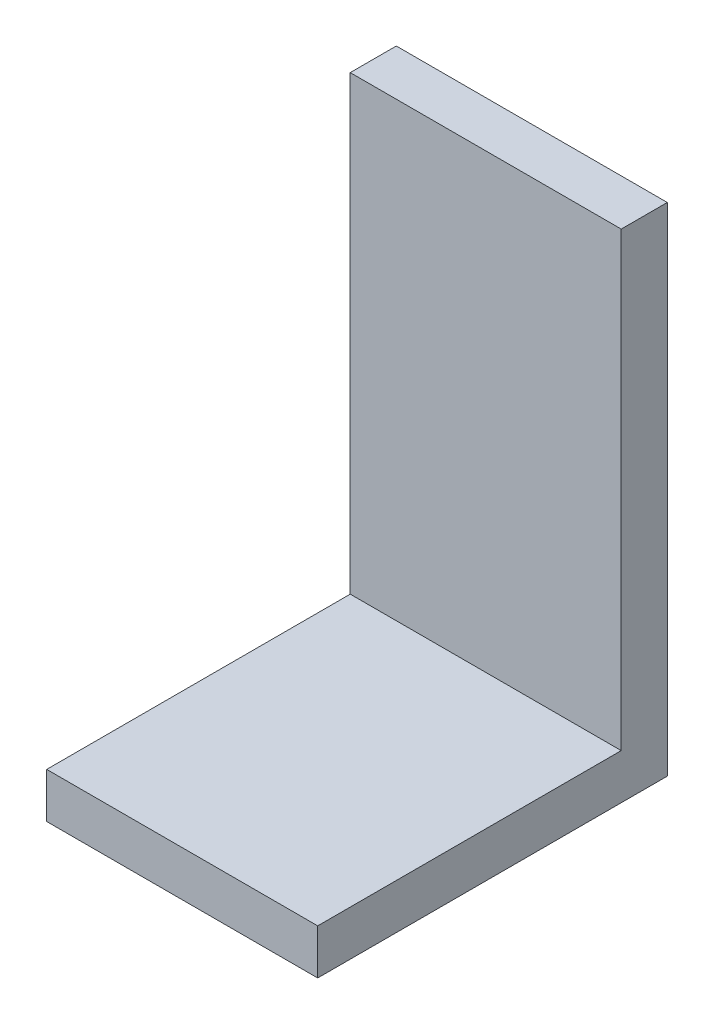
ISO-10303-21;
HEADER;
FILE_DESCRIPTION(('STEP AP214'),'2;1');
FILE_NAME('part.step','',(''),(''),'','','');
FILE_SCHEMA(('AUTOMOTIVE_DESIGN { 1 0 10303 214 1 1 1 1 }'));
ENDSEC;
DATA;
#1=APPLICATION_CONTEXT('core data for automotive mechanical design processes');
#2=APPLICATION_PROTOCOL_DEFINITION('international standard','automotive_design',2000,#1);
#3=PRODUCT_CONTEXT('',#1,'mechanical');
#4=PRODUCT('Part','Part','',(#3));
#5=PRODUCT_RELATED_PRODUCT_CATEGORY('part','',(#4));
#6=PRODUCT_DEFINITION_FORMATION('','',#4);
#7=PRODUCT_DEFINITION_CONTEXT('part definition',#1,'design');
#8=PRODUCT_DEFINITION('design','',#6,#7);
#9=PRODUCT_DEFINITION_SHAPE('','',#8);
#10=(LENGTH_UNIT() NAMED_UNIT(*) SI_UNIT(.MILLI.,.METRE.));
#11=(NAMED_UNIT(*) PLANE_ANGLE_UNIT() SI_UNIT($,.RADIAN.));
#12=(NAMED_UNIT(*) SI_UNIT($,.STERADIAN.) SOLID_ANGLE_UNIT());
#13=UNCERTAINTY_MEASURE_WITH_UNIT(LENGTH_MEASURE(1.E-05),#10,'distance_accuracy_value','');
#14=(GEOMETRIC_REPRESENTATION_CONTEXT(3) GLOBAL_UNCERTAINTY_ASSIGNED_CONTEXT((#13)) GLOBAL_UNIT_ASSIGNED_CONTEXT((#10,
#11,#12)) REPRESENTATION_CONTEXT('',''));
#15=CARTESIAN_POINT('',(0.,0.,0.));
#16=DIRECTION('',(0.,0.,1.));
#17=DIRECTION('',(1.,0.,0.));
#18=AXIS2_PLACEMENT_3D('',#15,#16,#17);
#19=CARTESIAN_POINT('',(3.4,-4.55,0.));
#20=DIRECTION('',(1.,0.,0.));
#21=DIRECTION('',(0.,0.,1.));
#22=AXIS2_PLACEMENT_3D('',#19,#20,#21);
#23=PLANE('',#22);
#24=DIRECTION('',(0.,-1.,0.));
#25=VECTOR('',#24,1.);
#26=CARTESIAN_POINT('',(3.4,-4.,0.));
#27=LINE('',#26,#25);
#28=CARTESIAN_POINT('',(3.4,-4.,0.));
#29=VERTEX_POINT('',#28);
#30=CARTESIAN_POINT('',(3.4,-4.55,0.));
#31=VERTEX_POINT('',#30);
#32=EDGE_CURVE('E11',#29,#31,#27,.T.);
#33=ORIENTED_EDGE('',*,*,#32,.F.);
#34=DIRECTION('',(0.,0.,-1.));
#35=VECTOR('',#34,1.);
#36=CARTESIAN_POINT('',(3.4,-4.,0.051));
#37=LINE('',#36,#35);
#38=CARTESIAN_POINT('',(3.4,-4.,0.051));
#39=VERTEX_POINT('',#38);
#40=EDGE_CURVE('E24',#39,#29,#37,.T.);
#41=ORIENTED_EDGE('',*,*,#40,.F.);
#42=DIRECTION('',(0.,1.,0.));
#43=VECTOR('',#42,1.);
#44=CARTESIAN_POINT('',(3.4,-4.5,0.051));
#45=LINE('',#44,#43);
#46=CARTESIAN_POINT('',(3.4,-4.5,0.051));
#47=VERTEX_POINT('',#46);
#48=EDGE_CURVE('E87',#47,#39,#45,.T.);
#49=ORIENTED_EDGE('',*,*,#48,.F.);
#50=DIRECTION('',(0.,0.,-1.));
#51=VECTOR('',#50,1.);
#52=CARTESIAN_POINT('',(3.4,-4.5,0.387));
#53=LINE('',#52,#51);
#54=CARTESIAN_POINT('',(3.4,-4.5,0.387));
#55=VERTEX_POINT('',#54);
#56=EDGE_CURVE('E114',#55,#47,#53,.T.);
#57=ORIENTED_EDGE('',*,*,#56,.F.);
#58=DIRECTION('',(0.,1.,0.));
#59=VECTOR('',#58,1.);
#60=CARTESIAN_POINT('',(3.4,-4.55,0.387));
#61=LINE('',#60,#59);
#62=CARTESIAN_POINT('',(3.4,-4.55,0.387));
#63=VERTEX_POINT('',#62);
#64=EDGE_CURVE('E111',#63,#55,#61,.T.);
#65=ORIENTED_EDGE('',*,*,#64,.F.);
#66=DIRECTION('',(0.,0.,1.));
#67=VECTOR('',#66,1.);
#68=CARTESIAN_POINT('',(3.4,-4.55,0.));
#69=LINE('',#68,#67);
#70=EDGE_CURVE('E108',#31,#63,#69,.T.);
#71=ORIENTED_EDGE('',*,*,#70,.F.);
#72=EDGE_LOOP('',(#33,#41,#49,#57,#65,#71));
#73=FACE_BOUND('',#72,.T.);
#74=ADVANCED_FACE('F17',(#73),#23,.T.);
#75=CARTESIAN_POINT('',(3.1,-4.,0.));
#76=DIRECTION('',(-1.,0.,0.));
#77=DIRECTION('',(0.,0.,1.));
#78=AXIS2_PLACEMENT_3D('',#75,#76,#77);
#79=PLANE('',#78);
#80=DIRECTION('',(0.,1.,0.));
#81=VECTOR('',#80,1.);
#82=CARTESIAN_POINT('',(3.1,-4.55,0.));
#83=LINE('',#82,#81);
#84=CARTESIAN_POINT('',(3.1,-4.55,0.));
#85=VERTEX_POINT('',#84);
#86=CARTESIAN_POINT('',(3.1,-4.,0.));
#87=VERTEX_POINT('',#86);
#88=EDGE_CURVE('E106',#85,#87,#83,.T.);
#89=ORIENTED_EDGE('',*,*,#88,.F.);
#90=DIRECTION('',(0.,0.,-1.));
#91=VECTOR('',#90,1.);
#92=CARTESIAN_POINT('',(3.1,-4.55,0.387));
#93=LINE('',#92,#91);
#94=CARTESIAN_POINT('',(3.1,-4.55,0.387));
#95=VERTEX_POINT('',#94);
#96=EDGE_CURVE('E103',#95,#85,#93,.T.);
#97=ORIENTED_EDGE('',*,*,#96,.F.);
#98=DIRECTION('',(0.,-1.,0.));
#99=VECTOR('',#98,1.);
#100=CARTESIAN_POINT('',(3.1,-4.5,0.387));
#101=LINE('',#100,#99);
#102=CARTESIAN_POINT('',(3.1,-4.5,0.387));
#103=VERTEX_POINT('',#102);
#104=EDGE_CURVE('E100',#103,#95,#101,.T.);
#105=ORIENTED_EDGE('',*,*,#104,.F.);
#106=DIRECTION('',(0.,0.,1.));
#107=VECTOR('',#106,1.);
#108=CARTESIAN_POINT('',(3.1,-4.5,0.051));
#109=LINE('',#108,#107);
#110=CARTESIAN_POINT('',(3.1,-4.5,0.051));
#111=VERTEX_POINT('',#110);
#112=EDGE_CURVE('E72',#111,#103,#109,.T.);
#113=ORIENTED_EDGE('',*,*,#112,.F.);
#114=DIRECTION('',(0.,-1.,0.));
#115=VECTOR('',#114,1.);
#116=CARTESIAN_POINT('',(3.1,-4.,0.051));
#117=LINE('',#116,#115);
#118=CARTESIAN_POINT('',(3.1,-4.,0.051));
#119=VERTEX_POINT('',#118);
#120=EDGE_CURVE('E66',#119,#111,#117,.T.);
#121=ORIENTED_EDGE('',*,*,#120,.F.);
#122=DIRECTION('',(0.,0.,1.));
#123=VECTOR('',#122,1.);
#124=CARTESIAN_POINT('',(3.1,-4.,0.));
#125=LINE('',#124,#123);
#126=EDGE_CURVE('E69',#87,#119,#125,.T.);
#127=ORIENTED_EDGE('',*,*,#126,.F.);
#128=EDGE_LOOP('',(#89,#97,#105,#113,#121,#127));
#129=FACE_BOUND('',#128,.T.);
#130=ADVANCED_FACE('F68',(#129),#79,.T.);
#131=CARTESIAN_POINT('',(3.4,-4.55,0.387));
#132=DIRECTION('',(0.,0.,1.));
#133=DIRECTION('',(0.,1.,0.));
#134=AXIS2_PLACEMENT_3D('',#131,#132,#133);
#135=PLANE('',#134);
#136=ORIENTED_EDGE('',*,*,#64,.T.);
#137=DIRECTION('',(1.,0.,0.));
#138=VECTOR('',#137,1.);
#139=CARTESIAN_POINT('',(3.1,-4.5,0.387));
#140=LINE('',#139,#138);
#141=EDGE_CURVE('E83',#103,#55,#140,.T.);
#142=ORIENTED_EDGE('',*,*,#141,.F.);
#143=ORIENTED_EDGE('',*,*,#104,.T.);
#144=DIRECTION('',(-1.,0.,0.));
#145=VECTOR('',#144,1.);
#146=CARTESIAN_POINT('',(3.4,-4.55,0.387));
#147=LINE('',#146,#145);
#148=EDGE_CURVE('E88',#63,#95,#147,.T.);
#149=ORIENTED_EDGE('',*,*,#148,.F.);
#150=EDGE_LOOP('',(#136,#142,#143,#149));
#151=FACE_BOUND('',#150,.T.);
#152=ADVANCED_FACE('F125',(#151),#135,.T.);
#153=CARTESIAN_POINT('',(3.4,-4.5,0.051));
#154=DIRECTION('',(0.,0.,1.));
#155=DIRECTION('',(0.,1.,0.));
#156=AXIS2_PLACEMENT_3D('',#153,#154,#155);
#157=PLANE('',#156);
#158=ORIENTED_EDGE('',*,*,#48,.T.);
#159=DIRECTION('',(1.,0.,0.));
#160=VECTOR('',#159,1.);
#161=CARTESIAN_POINT('',(3.1,-4.,0.051));
#162=LINE('',#161,#160);
#163=EDGE_CURVE('E81',#119,#39,#162,.T.);
#164=ORIENTED_EDGE('',*,*,#163,.F.);
#165=ORIENTED_EDGE('',*,*,#120,.T.);
#166=DIRECTION('',(-1.,0.,0.));
#167=VECTOR('',#166,1.);
#168=CARTESIAN_POINT('',(3.4,-4.5,0.051));
#169=LINE('',#168,#167);
#170=EDGE_CURVE('E89',#47,#111,#169,.T.);
#171=ORIENTED_EDGE('',*,*,#170,.F.);
#172=EDGE_LOOP('',(#158,#164,#165,#171));
#173=FACE_BOUND('',#172,.T.);
#174=ADVANCED_FACE('F86',(#173),#157,.T.);
#175=CARTESIAN_POINT('',(3.1,-4.55,0.));
#176=DIRECTION('',(0.,-1.,0.));
#177=DIRECTION('',(0.,0.,1.));
#178=AXIS2_PLACEMENT_3D('',#175,#176,#177);
#179=PLANE('',#178);
#180=DIRECTION('',(-1.,0.,0.));
#181=VECTOR('',#180,1.);
#182=CARTESIAN_POINT('',(3.4,-4.55,0.));
#183=LINE('',#182,#181);
#184=EDGE_CURVE('E93',#31,#85,#183,.T.);
#185=ORIENTED_EDGE('',*,*,#184,.F.);
#186=ORIENTED_EDGE('',*,*,#70,.T.);
#187=ORIENTED_EDGE('',*,*,#148,.T.);
#188=ORIENTED_EDGE('',*,*,#96,.T.);
#189=EDGE_LOOP('',(#185,#186,#187,#188));
#190=FACE_BOUND('',#189,.T.);
#191=ADVANCED_FACE('F121',(#190),#179,.T.);
#192=CARTESIAN_POINT('',(3.4,-4.,0.));
#193=DIRECTION('',(0.,1.,0.));
#194=DIRECTION('',(0.,0.,1.));
#195=AXIS2_PLACEMENT_3D('',#192,#193,#194);
#196=PLANE('',#195);
#197=DIRECTION('',(1.,0.,0.));
#198=VECTOR('',#197,1.);
#199=CARTESIAN_POINT('',(3.1,-4.,0.));
#200=LINE('',#199,#198);
#201=EDGE_CURVE('E82',#87,#29,#200,.T.);
#202=ORIENTED_EDGE('',*,*,#201,.F.);
#203=ORIENTED_EDGE('',*,*,#126,.T.);
#204=ORIENTED_EDGE('',*,*,#163,.T.);
#205=ORIENTED_EDGE('',*,*,#40,.T.);
#206=EDGE_LOOP('',(#202,#203,#204,#205));
#207=FACE_BOUND('',#206,.T.);
#208=ADVANCED_FACE('F80',(#207),#196,.T.);
#209=CARTESIAN_POINT('',(3.4,-4.5,0.051));
#210=DIRECTION('',(0.,1.,0.));
#211=DIRECTION('',(0.,0.,1.));
#212=AXIS2_PLACEMENT_3D('',#209,#210,#211);
#213=PLANE('',#212);
#214=ORIENTED_EDGE('',*,*,#170,.T.);
#215=ORIENTED_EDGE('',*,*,#112,.T.);
#216=ORIENTED_EDGE('',*,*,#141,.T.);
#217=ORIENTED_EDGE('',*,*,#56,.T.);
#218=EDGE_LOOP('',(#214,#215,#216,#217));
#219=FACE_BOUND('',#218,.T.);
#220=ADVANCED_FACE('F127',(#219),#213,.T.);
#221=CARTESIAN_POINT('',(3.1,-4.55,0.));
#222=DIRECTION('',(0.,0.,-1.));
#223=DIRECTION('',(0.,1.,0.));
#224=AXIS2_PLACEMENT_3D('',#221,#222,#223);
#225=PLANE('',#224);
#226=ORIENTED_EDGE('',*,*,#88,.T.);
#227=ORIENTED_EDGE('',*,*,#201,.T.);
#228=ORIENTED_EDGE('',*,*,#32,.T.);
#229=ORIENTED_EDGE('',*,*,#184,.T.);
#230=EDGE_LOOP('',(#226,#227,#228,#229));
#231=FACE_BOUND('',#230,.T.);
#232=ADVANCED_FACE('F117',(#231),#225,.T.);
#233=CLOSED_SHELL('',(#74,#130,#152,#174,#191,#208,#220,#232));
#234=MANIFOLD_SOLID_BREP('B1',#233);
#235=ADVANCED_BREP_SHAPE_REPRESENTATION('',(#18,#234),#14);
#236=SHAPE_DEFINITION_REPRESENTATION(#9,#235);
ENDSEC;
END-ISO-10303-21;
